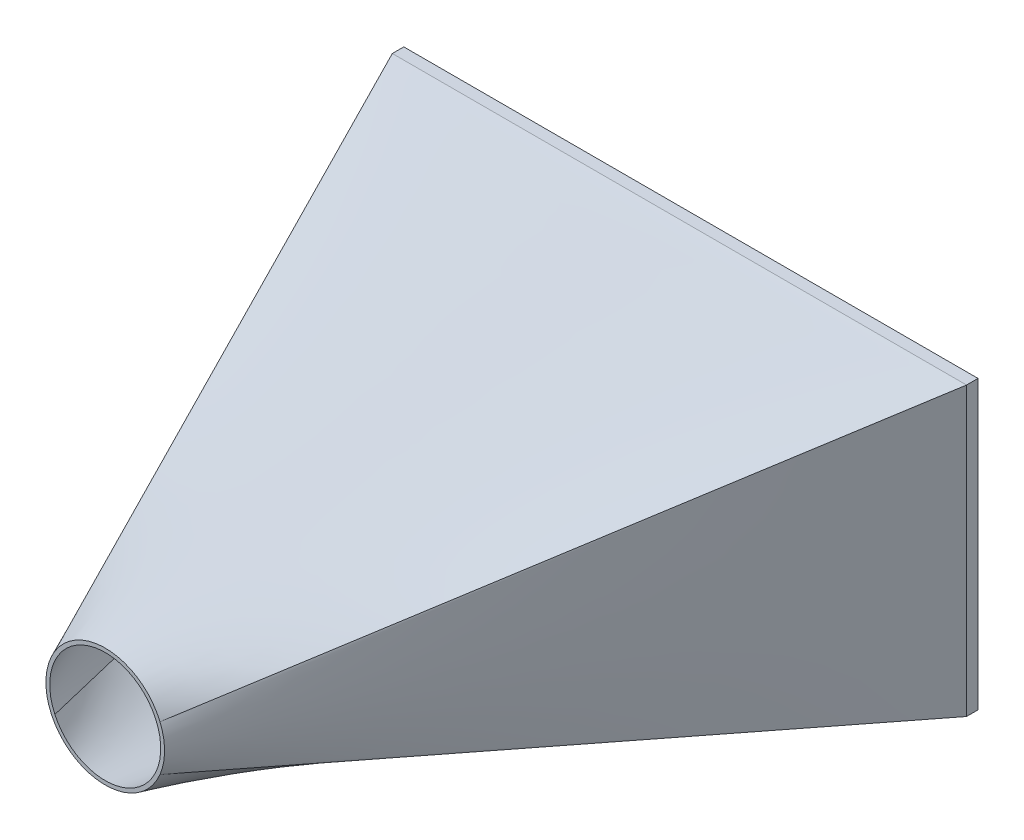
ISO-10303-21;
HEADER;
FILE_DESCRIPTION(('STEP AP214'),'2;1');
FILE_NAME('part.step','',(''),(''),'','','');
FILE_SCHEMA(('AUTOMOTIVE_DESIGN { 1 0 10303 214 1 1 1 1 }'));
ENDSEC;
DATA;
#1=APPLICATION_CONTEXT('core data for automotive mechanical design processes');
#2=APPLICATION_PROTOCOL_DEFINITION('international standard','automotive_design',2000,#1);
#3=PRODUCT_CONTEXT('',#1,'mechanical');
#4=PRODUCT('Part','Part','',(#3));
#5=PRODUCT_RELATED_PRODUCT_CATEGORY('part','',(#4));
#6=PRODUCT_DEFINITION_FORMATION('','',#4);
#7=PRODUCT_DEFINITION_CONTEXT('part definition',#1,'design');
#8=PRODUCT_DEFINITION('design','',#6,#7);
#9=PRODUCT_DEFINITION_SHAPE('','',#8);
#10=(LENGTH_UNIT() NAMED_UNIT(*) SI_UNIT(.MILLI.,.METRE.));
#11=(NAMED_UNIT(*) PLANE_ANGLE_UNIT() SI_UNIT($,.RADIAN.));
#12=(NAMED_UNIT(*) SI_UNIT($,.STERADIAN.) SOLID_ANGLE_UNIT());
#13=UNCERTAINTY_MEASURE_WITH_UNIT(LENGTH_MEASURE(1.E-05),#10,'distance_accuracy_value','');
#14=(GEOMETRIC_REPRESENTATION_CONTEXT(3) GLOBAL_UNCERTAINTY_ASSIGNED_CONTEXT((#13)) GLOBAL_UNIT_ASSIGNED_CONTEXT((#10,
#11,#12)) REPRESENTATION_CONTEXT('',''));
#15=CARTESIAN_POINT('',(0.,0.,0.));
#16=DIRECTION('',(0.,0.,1.));
#17=DIRECTION('',(1.,0.,0.));
#18=AXIS2_PLACEMENT_3D('',#15,#16,#17);
#19=CARTESIAN_POINT('',(0.,0.,150.));
#20=DIRECTION('',(0.,0.,1.));
#21=DIRECTION('',(1.,0.,0.));
#22=AXIS2_PLACEMENT_3D('',#19,#20,#21);
#23=PLANE('',#22);
#24=CARTESIAN_POINT('',(0.,0.,150.));
#25=DIRECTION('',(0.,0.,1.));
#26=DIRECTION('',(1.,0.,0.));
#27=AXIS2_PLACEMENT_3D('',#24,#25,#26);
#28=CIRCLE('',#27,14.5);
#29=CARTESIAN_POINT('',(13.1516300323523,6.10611394359212,150.));
#30=VERTEX_POINT('',#29);
#31=CARTESIAN_POINT('',(-13.1516300323523,6.10611394359212,150.));
#32=VERTEX_POINT('',#31);
#33=EDGE_CURVE('E248',#30,#32,#28,.T.);
#34=ORIENTED_EDGE('',*,*,#33,.F.);
#35=CARTESIAN_POINT('',(13.1516300323523,-6.10611394359212,150.));
#36=VERTEX_POINT('',#35);
#37=EDGE_CURVE('E230',#36,#30,#28,.T.);
#38=ORIENTED_EDGE('',*,*,#37,.F.);
#39=CARTESIAN_POINT('',(-13.1516300323523,-6.10611394359212,150.));
#40=VERTEX_POINT('',#39);
#41=EDGE_CURVE('E237',#40,#36,#28,.T.);
#42=ORIENTED_EDGE('',*,*,#41,.F.);
#43=EDGE_CURVE('E153',#32,#40,#28,.T.);
#44=ORIENTED_EDGE('',*,*,#43,.F.);
#45=EDGE_LOOP('',(#34,#38,#42,#44));
#46=FACE_BOUND('',#45,.T.);
#47=CARTESIAN_POINT('',(0.,0.,150.));
#48=DIRECTION('',(0.,0.,1.));
#49=DIRECTION('',(1.,0.,0.));
#50=AXIS2_PLACEMENT_3D('',#47,#48,#49);
#51=CIRCLE('',#50,15.5);
#52=CARTESIAN_POINT('',(-13.1439737120789,8.21498357004929,150.));
#53=VERTEX_POINT('',#52);
#54=CARTESIAN_POINT('',(-13.1439737120789,-8.21498357004929,150.));
#55=VERTEX_POINT('',#54);
#56=EDGE_CURVE('E13',#53,#55,#51,.T.);
#57=ORIENTED_EDGE('',*,*,#56,.T.);
#58=CARTESIAN_POINT('',(14.3076923076923,-5.96153846153847,150.));
#59=VERTEX_POINT('',#58);
#60=EDGE_CURVE('E159',#55,#59,#51,.T.);
#61=ORIENTED_EDGE('',*,*,#60,.T.);
#62=CARTESIAN_POINT('',(14.3076923076923,5.96153846153846,150.));
#63=VERTEX_POINT('',#62);
#64=EDGE_CURVE('E360',#59,#63,#51,.T.);
#65=ORIENTED_EDGE('',*,*,#64,.T.);
#66=EDGE_CURVE('E376',#63,#53,#51,.T.);
#67=ORIENTED_EDGE('',*,*,#66,.T.);
#68=EDGE_LOOP('',(#57,#61,#65,#67));
#69=FACE_BOUND('',#68,.T.);
#70=ADVANCED_FACE('F149',(#46,#69),#23,.T.);
#71=CARTESIAN_POINT('',(-75.,37.5,0.));
#72=CARTESIAN_POINT('',(-54.3813245706929,27.7383278566831,50.));
#73=CARTESIAN_POINT('',(-33.7626491413859,17.9766557133662,100.));
#74=CARTESIAN_POINT('',(-13.1439737120789,8.21498357004929,150.));
#75=CARTESIAN_POINT('',(-75.,34.3480913300967,0.));
#76=CARTESIAN_POINT('',(-54.5077647415209,25.4347511367561,50.));
#77=CARTESIAN_POINT('',(-34.0155294830419,16.5214109434155,100.));
#78=CARTESIAN_POINT('',(-13.5232942245628,7.60807075007492,150.));
#79=CARTESIAN_POINT('',(-75.,28.0715836517034,0.));
#80=CARTESIAN_POINT('',(-54.733578202343,20.8266137712256,49.9999999999999));
#81=CARTESIAN_POINT('',(-34.467156404686,13.5816438907478,99.9999999999999));
#82=CARTESIAN_POINT('',(-14.2007346070291,6.33667401026998,150.));
#83=CARTESIAN_POINT('',(-75.,18.7067832596335,0.));
#84=CARTESIAN_POINT('',(-54.9818213713129,13.9032874783124,50.0000000000001));
#85=CARTESIAN_POINT('',(-34.9636427426259,9.09979169699141,100.));
#86=CARTESIAN_POINT('',(-14.9454641139388,4.29629591567037,150.));
#87=CARTESIAN_POINT('',(-75.,9.36168901280311,0.));
#88=CARTESIAN_POINT('',(-55.1329990944764,6.96363626825477,49.9999999999999));
#89=CARTESIAN_POINT('',(-35.2659981889529,4.56558352370644,99.9999999999999));
#90=CARTESIAN_POINT('',(-15.3989972834294,2.1675307791581,150.));
#91=CARTESIAN_POINT('',(-75.,3.12499999999998,0.));
#92=CARTESIAN_POINT('',(-55.1666666666667,2.32384136936492,50.));
#93=CARTESIAN_POINT('',(-35.3333333333333,1.52268273872985,100.));
#94=CARTESIAN_POINT('',(-15.5,0.721524108094778,150.));
#95=CARTESIAN_POINT('',(-75.,-3.125,0.));
#96=CARTESIAN_POINT('',(-55.1666666666667,-2.32384136936492,50.));
#97=CARTESIAN_POINT('',(-35.3333333333333,-1.52268273872985,100.));
#98=CARTESIAN_POINT('',(-15.5,-0.721524108094774,150.));
#99=CARTESIAN_POINT('',(-74.9999999999999,-9.3616890128031,0.));
#100=CARTESIAN_POINT('',(-55.1329990944764,-6.96363626825476,50.));
#101=CARTESIAN_POINT('',(-35.2659981889529,-4.56558352370643,100.));
#102=CARTESIAN_POINT('',(-15.3989972834294,-2.16753077915809,150.));
#103=CARTESIAN_POINT('',(-75.0000000000001,-18.7067832596335,0.));
#104=CARTESIAN_POINT('',(-54.981821371313,-13.9032874783124,49.9999999999999));
#105=CARTESIAN_POINT('',(-34.9636427426259,-9.0997916969914,99.9999999999999));
#106=CARTESIAN_POINT('',(-14.9454641139389,-4.29629591567037,150.));
#107=CARTESIAN_POINT('',(-74.9999999999999,-28.0715836517034,0.));
#108=CARTESIAN_POINT('',(-54.733578202343,-20.8266137712256,50.0000000000001));
#109=CARTESIAN_POINT('',(-34.467156404686,-13.5816438907478,100.));
#110=CARTESIAN_POINT('',(-14.2007346070291,-6.33667401026998,150.));
#111=CARTESIAN_POINT('',(-75.,-34.3480913300968,0.));
#112=CARTESIAN_POINT('',(-54.5077647415209,-25.4347511367561,50.));
#113=CARTESIAN_POINT('',(-34.0155294830419,-16.5214109434155,100.));
#114=CARTESIAN_POINT('',(-13.5232942245628,-7.60807075007492,150.));
#115=CARTESIAN_POINT('',(-75.,-37.5,0.));
#116=CARTESIAN_POINT('',(-54.3813245706929,-27.7383278566831,50.));
#117=CARTESIAN_POINT('',(-33.7626491413859,-17.9766557133662,100.));
#118=CARTESIAN_POINT('',(-13.1439737120789,-8.21498357004929,150.));
#119=B_SPLINE_SURFACE_WITH_KNOTS('',3,3,((#71,#72,#73,#74),(#75,#76,#77,#78),(#79,#80,#81,#82),
(#83,#84,#85,#86),(#87,#88,#89,#90),(#91,#92,#93,#94),(#95,#96,#97,#98),(#99,#100,#101,#102),
(#103,#104,#105,#106),(#107,#108,#109,#110),(#111,#112,#113,#114),(#115,#116,#117,#118)),
.UNSPECIFIED.,.F.,.F.,.F.,(4,1,1,1,2,1,1,1,4),(4,4),(0.82776282442199,0.849292471369241,
0.870822118316493,0.892351765263744,0.913881412210995,0.935411059158246,0.956940706105498,
0.978470353052749,1.),(0.,1.),.UNSPECIFIED.);
#120=DIRECTION('',(0.,-1.,0.));
#121=VECTOR('',#120,1.);
#122=CARTESIAN_POINT('',(-75.,-37.5,0.));
#123=LINE('',#122,#121);
#124=CARTESIAN_POINT('',(-75.,37.5,0.));
#125=VERTEX_POINT('',#124);
#126=CARTESIAN_POINT('',(-75.,-37.5,0.));
#127=VERTEX_POINT('',#126);
#128=EDGE_CURVE('E448',#125,#127,#123,.T.);
#129=CARTESIAN_POINT('',(-75.,-37.5,0.));
#130=CARTESIAN_POINT('',(-54.3813245706929,-27.7383278566831,50.));
#131=CARTESIAN_POINT('',(-33.7626491413859,-17.9766557133662,100.));
#132=CARTESIAN_POINT('',(-13.1439737120789,-8.21498357004929,150.));
#133=B_SPLINE_CURVE_WITH_KNOTS('',3,(#129,#130,#131,#132),.UNSPECIFIED.,.F.,.F.,(4,4),(0.,1.),.UNSPECIFIED.);
#134=EDGE_CURVE('E315',#127,#55,#133,.T.);
#135=CARTESIAN_POINT('',(-75.,37.5,0.));
#136=CARTESIAN_POINT('',(-54.3813245706929,27.7383278566831,50.));
#137=CARTESIAN_POINT('',(-33.7626491413859,17.9766557133662,100.));
#138=CARTESIAN_POINT('',(-13.1439737120789,8.21498357004929,150.));
#139=B_SPLINE_CURVE_WITH_KNOTS('',3,(#135,#136,#137,#138),.UNSPECIFIED.,.F.,.F.,(4,4),(0.,1.),.UNSPECIFIED.);
#140=EDGE_CURVE('E498',#125,#53,#139,.T.);
#141=ORIENTED_EDGE('',*,*,#128,.T.);
#142=ORIENTED_EDGE('',*,*,#134,.T.);
#143=ORIENTED_EDGE('',*,*,#56,.F.);
#144=ORIENTED_EDGE('',*,*,#140,.F.);
#145=EDGE_LOOP('',(#141,#142,#143,#144));
#146=FACE_BOUND('',#145,.T.);
#147=ADVANCED_FACE('F545',(#146),#119,.T.);
#148=CARTESIAN_POINT('',(75.,37.5,0.));
#149=CARTESIAN_POINT('',(54.7692307692308,26.9871794871795,50.));
#150=CARTESIAN_POINT('',(34.5384615384615,16.474358974359,100.));
#151=CARTESIAN_POINT('',(14.3076923076923,5.96153846153846,150.));
#152=CARTESIAN_POINT('',(68.75,37.5,0.));
#153=CARTESIAN_POINT('',(50.4213828307885,27.422014539441,50.));
#154=CARTESIAN_POINT('',(32.0927656615769,17.3440290788821,100.));
#155=CARTESIAN_POINT('',(13.7641484923654,7.26604361832312,150.));
#156=CARTESIAN_POINT('',(56.25,37.5,0.));
#157=CARTESIAN_POINT('',(41.6060925384674,28.2418014610322,50.0000000000001));
#158=CARTESIAN_POINT('',(26.9621850769348,18.9836029220643,100.));
#159=CARTESIAN_POINT('',(12.3182776154021,9.7254043830965,150.));
#160=CARTESIAN_POINT('',(37.5,37.5,0.));
#161=CARTESIAN_POINT('',(28.0776991408358,29.2304387935331,49.9999999999999));
#162=CARTESIAN_POINT('',(18.6553982816716,20.9608775870662,99.9999999999998));
#163=CARTESIAN_POINT('',(9.23309742250735,12.6913163805993,150.));
#164=CARTESIAN_POINT('',(18.75,37.5,0.));
#165=CARTESIAN_POINT('',(14.3205481786736,29.9045504765037,50.0000000000001));
#166=CARTESIAN_POINT('',(9.89109635734726,22.3091009530074,100.));
#167=CARTESIAN_POINT('',(5.46164453602088,14.713651429511,150.));
#168=CARTESIAN_POINT('',(0.,37.5,0.));
#169=CARTESIAN_POINT('',(0.42800518197786,30.2139966782469,50.));
#170=CARTESIAN_POINT('',(0.856010363955703,22.9279933564937,99.9999999999999));
#171=CARTESIAN_POINT('',(1.28401554593354,15.6419900347406,150.));
#172=CARTESIAN_POINT('',(-18.75,37.5,0.));
#173=CARTESIAN_POINT('',(-13.4963598480115,30.1357840784748,50.0000000000001));
#174=CARTESIAN_POINT('',(-8.24271969602309,22.7715681569495,100.));
#175=CARTESIAN_POINT('',(-2.98907954403465,15.4073522354243,150.));
#176=CARTESIAN_POINT('',(-37.5,37.5,0.));
#177=CARTESIAN_POINT('',(-27.3466136866288,29.6757083520101,50.));
#178=CARTESIAN_POINT('',(-17.1932273732576,21.8514167040203,99.9999999999999));
#179=CARTESIAN_POINT('',(-7.03984105988643,14.0271250560304,150.));
#180=CARTESIAN_POINT('',(-56.25,37.5,0.));
#181=CARTESIAN_POINT('',(-41.022464016694,28.8680123963483,50.));
#182=CARTESIAN_POINT('',(-25.7949280333879,20.2360247926966,100.));
#183=CARTESIAN_POINT('',(-10.5673920500819,11.6040371890449,150.));
#184=CARTESIAN_POINT('',(-68.75,37.5,0.));
#185=CARTESIAN_POINT('',(-49.9649906108535,28.1377955257595,50.));
#186=CARTESIAN_POINT('',(-31.1799812217071,18.775591051519,100.));
#187=CARTESIAN_POINT('',(-12.3949718325606,9.41338657727851,150.));
#188=CARTESIAN_POINT('',(-75.,37.5,0.));
#189=CARTESIAN_POINT('',(-54.3813245706929,27.7383278566831,50.));
#190=CARTESIAN_POINT('',(-33.7626491413859,17.9766557133662,100.));
#191=CARTESIAN_POINT('',(-13.1439737120789,8.21498357004929,150.));
#192=B_SPLINE_SURFACE_WITH_KNOTS('',3,3,((#148,#149,#150,#151),(#152,#153,#154,#155),(#156,#157,
#158,#159),(#160,#161,#162,#163),(#164,#165,#166,#167),(#168,#169,#170,#171),(#172,#173,#174,
#175),(#176,#177,#178,#179),(#180,#181,#182,#183),(#184,#185,#186,#187),(#188,#189,#190,#191)),
.UNSPECIFIED.,.F.,.F.,.F.,(4,1,1,1,1,1,1,1,4),(4,4),(0.486964557972162,0.529564341278391,
0.572164124584619,0.614763907890848,0.657363691197076,0.699963474503305,0.742563257809533,
0.785163041115762,0.82776282442199),(0.,1.),.UNSPECIFIED.);
#193=DIRECTION('',(-1.,0.,0.));
#194=VECTOR('',#193,1.);
#195=CARTESIAN_POINT('',(-75.,37.5,0.));
#196=LINE('',#195,#194);
#197=CARTESIAN_POINT('',(75.,37.5,0.));
#198=VERTEX_POINT('',#197);
#199=EDGE_CURVE('E418',#198,#125,#196,.T.);
#200=CARTESIAN_POINT('',(75.,37.5,0.));
#201=CARTESIAN_POINT('',(54.7692307692308,26.9871794871795,50.));
#202=CARTESIAN_POINT('',(34.5384615384615,16.474358974359,100.));
#203=CARTESIAN_POINT('',(14.3076923076923,5.96153846153846,150.));
#204=B_SPLINE_CURVE_WITH_KNOTS('',3,(#200,#201,#202,#203),.UNSPECIFIED.,.F.,.F.,(4,4),(0.,1.),.UNSPECIFIED.);
#205=EDGE_CURVE('E496',#198,#63,#204,.T.);
#206=ORIENTED_EDGE('',*,*,#199,.T.);
#207=ORIENTED_EDGE('',*,*,#140,.T.);
#208=ORIENTED_EDGE('',*,*,#66,.F.);
#209=ORIENTED_EDGE('',*,*,#205,.F.);
#210=EDGE_LOOP('',(#206,#207,#208,#209));
#211=FACE_BOUND('',#210,.T.);
#212=ADVANCED_FACE('F535',(#211),#192,.T.);
#213=CARTESIAN_POINT('',(75.,-37.5,0.));
#214=CARTESIAN_POINT('',(54.7692307692308,-26.9871794871795,50.));
#215=CARTESIAN_POINT('',(34.5384615384615,-16.474358974359,100.));
#216=CARTESIAN_POINT('',(14.3076923076923,-5.96153846153847,150.));
#217=CARTESIAN_POINT('',(75.,-31.25,0.));
#218=CARTESIAN_POINT('',(54.8999842367419,-22.506704498486,50.));
#219=CARTESIAN_POINT('',(34.7999684734839,-13.7634089969721,100.));
#220=CARTESIAN_POINT('',(14.6999527102258,-5.02011349545814,150.));
#221=CARTESIAN_POINT('',(75.,-18.75,0.));
#222=CARTESIAN_POINT('',(55.0993623990392,-13.5198743913001,49.9999999999999));
#223=CARTESIAN_POINT('',(35.1987247980783,-8.28974878260024,99.9999999999998));
#224=CARTESIAN_POINT('',(15.2980871971175,-3.05962317390036,150.));
#225=CARTESIAN_POINT('',(75.,0.,0.));
#226=CARTESIAN_POINT('',(55.2003325301252,0.,50.0000000000001));
#227=CARTESIAN_POINT('',(35.4006650602503,0.,100.));
#228=CARTESIAN_POINT('',(15.6009975903755,0.,150.));
#229=CARTESIAN_POINT('',(75.,18.75,0.));
#230=CARTESIAN_POINT('',(55.0993623990392,13.5198743913001,49.9999999999999));
#231=CARTESIAN_POINT('',(35.1987247980783,8.28974878260024,99.9999999999998));
#232=CARTESIAN_POINT('',(15.2980871971175,3.05962317390035,150.));
#233=CARTESIAN_POINT('',(75.,31.25,0.));
#234=CARTESIAN_POINT('',(54.8999842367419,22.506704498486,50.));
#235=CARTESIAN_POINT('',(34.7999684734839,13.7634089969721,100.));
#236=CARTESIAN_POINT('',(14.6999527102258,5.02011349545814,150.));
#237=CARTESIAN_POINT('',(75.,37.5,0.));
#238=CARTESIAN_POINT('',(54.7692307692308,26.9871794871795,50.));
#239=CARTESIAN_POINT('',(34.5384615384615,16.474358974359,100.));
#240=CARTESIAN_POINT('',(14.3076923076923,5.96153846153846,150.));
#241=B_SPLINE_SURFACE_WITH_KNOTS('',3,3,((#213,#214,#215,#216),(#217,#218,#219,#220),(#221,#222,
#223,#224),(#225,#226,#227,#228),(#229,#230,#231,#232),(#233,#234,#235,#236),(#237,#238,#239,
#240)),.UNSPECIFIED.,.F.,.F.,.F.,(4,1,1,1,4),(4,4),(0.340798266449828,0.377339839330411,
0.413881412210995,0.450422985091579,0.486964557972162),(0.,1.),.UNSPECIFIED.);
#242=DIRECTION('',(0.,1.,0.));
#243=VECTOR('',#242,1.);
#244=CARTESIAN_POINT('',(75.,-37.5,0.));
#245=LINE('',#244,#243);
#246=CARTESIAN_POINT('',(75.,-37.5,0.));
#247=VERTEX_POINT('',#246);
#248=EDGE_CURVE('E463',#247,#198,#245,.T.);
#249=CARTESIAN_POINT('',(75.,-37.5,0.));
#250=CARTESIAN_POINT('',(54.7692307692308,-26.9871794871795,50.));
#251=CARTESIAN_POINT('',(34.5384615384615,-16.474358974359,100.));
#252=CARTESIAN_POINT('',(14.3076923076923,-5.96153846153847,150.));
#253=B_SPLINE_CURVE_WITH_KNOTS('',3,(#249,#250,#251,#252),.UNSPECIFIED.,.F.,.F.,(4,4),(0.,1.),.UNSPECIFIED.);
#254=EDGE_CURVE('E495',#247,#59,#253,.T.);
#255=ORIENTED_EDGE('',*,*,#248,.T.);
#256=ORIENTED_EDGE('',*,*,#205,.T.);
#257=ORIENTED_EDGE('',*,*,#64,.F.);
#258=ORIENTED_EDGE('',*,*,#254,.F.);
#259=EDGE_LOOP('',(#255,#256,#257,#258));
#260=FACE_BOUND('',#259,.T.);
#261=ADVANCED_FACE('F330',(#260),#241,.T.);
#262=CARTESIAN_POINT('',(-75.,-37.5,0.));
#263=CARTESIAN_POINT('',(-54.3813245706929,-27.7383278566831,50.));
#264=CARTESIAN_POINT('',(-33.7626491413859,-17.9766557133662,100.));
#265=CARTESIAN_POINT('',(-13.1439737120789,-8.21498357004929,150.));
#266=CARTESIAN_POINT('',(-68.75,-37.5,0.));
#267=CARTESIAN_POINT('',(-49.9649906108535,-28.1377955257595,50.));
#268=CARTESIAN_POINT('',(-31.1799812217071,-18.775591051519,100.));
#269=CARTESIAN_POINT('',(-12.3949718325606,-9.41338657727851,150.));
#270=CARTESIAN_POINT('',(-56.25,-37.5,0.));
#271=CARTESIAN_POINT('',(-41.022464016694,-28.8680123963483,50.));
#272=CARTESIAN_POINT('',(-25.7949280333879,-20.2360247926966,99.9999999999999));
#273=CARTESIAN_POINT('',(-10.5673920500819,-11.6040371890449,150.));
#274=CARTESIAN_POINT('',(-37.5,-37.5,0.));
#275=CARTESIAN_POINT('',(-27.3466136866288,-29.6757083520101,50.));
#276=CARTESIAN_POINT('',(-17.1932273732576,-21.8514167040202,100.));
#277=CARTESIAN_POINT('',(-7.03984105988644,-14.0271250560304,150.));
#278=CARTESIAN_POINT('',(-18.75,-37.5,0.));
#279=CARTESIAN_POINT('',(-13.4963598480115,-30.1357840784748,50.));
#280=CARTESIAN_POINT('',(-8.2427196960231,-22.7715681569495,100.));
#281=CARTESIAN_POINT('',(-2.98907954403466,-15.4073522354243,150.));
#282=CARTESIAN_POINT('',(0.,-37.5,0.));
#283=CARTESIAN_POINT('',(0.428005181977863,-30.2139966782469,50.));
#284=CARTESIAN_POINT('',(0.856010363955692,-22.9279933564937,99.9999999999999));
#285=CARTESIAN_POINT('',(1.28401554593352,-15.6419900347405,150.));
#286=CARTESIAN_POINT('',(18.75,-37.5,0.));
#287=CARTESIAN_POINT('',(14.3205481786736,-29.9045504765037,50.0000000000001));
#288=CARTESIAN_POINT('',(9.89109635734727,-22.3091009530074,100.));
#289=CARTESIAN_POINT('',(5.4616445360209,-14.7136514295111,150.));
#290=CARTESIAN_POINT('',(37.5,-37.5,0.));
#291=CARTESIAN_POINT('',(28.0776991408358,-29.2304387935331,50.));
#292=CARTESIAN_POINT('',(18.6553982816716,-20.9608775870662,99.9999999999999));
#293=CARTESIAN_POINT('',(9.23309742250732,-12.6913163805993,150.));
#294=CARTESIAN_POINT('',(56.25,-37.5,0.));
#295=CARTESIAN_POINT('',(41.6060925384674,-28.2418014610322,50.));
#296=CARTESIAN_POINT('',(26.9621850769348,-18.9836029220644,100.));
#297=CARTESIAN_POINT('',(12.3182776154021,-9.72540438309654,150.));
#298=CARTESIAN_POINT('',(68.75,-37.5,0.));
#299=CARTESIAN_POINT('',(50.4213828307885,-27.422014539441,50.));
#300=CARTESIAN_POINT('',(32.0927656615769,-17.3440290788821,100.));
#301=CARTESIAN_POINT('',(13.7641484923654,-7.26604361832312,150.));
#302=CARTESIAN_POINT('',(75.,-37.5,0.));
#303=CARTESIAN_POINT('',(54.7692307692308,-26.9871794871795,50.));
#304=CARTESIAN_POINT('',(34.5384615384615,-16.474358974359,100.));
#305=CARTESIAN_POINT('',(14.3076923076923,-5.96153846153847,150.));
#306=B_SPLINE_SURFACE_WITH_KNOTS('',3,3,((#262,#263,#264,#265),(#266,#267,#268,#269),(#270,#271,
#272,#273),(#274,#275,#276,#277),(#278,#279,#280,#281),(#282,#283,#284,#285),(#286,#287,#288,
#289),(#290,#291,#292,#293),(#294,#295,#296,#297),(#298,#299,#300,#301),(#302,#303,#304,#305)),
.UNSPECIFIED.,.F.,.F.,.F.,(4,1,1,1,1,1,1,1,4),(4,4),(0.,0.0425997833062285,0.085199566612457,
0.127799349918685,0.170399133224914,0.212998916531142,0.255598699837371,0.298198483143599,
0.340798266449828),(0.,1.),.UNSPECIFIED.);
#307=DIRECTION('',(1.,0.,0.));
#308=VECTOR('',#307,1.);
#309=CARTESIAN_POINT('',(-75.,-37.5,0.));
#310=LINE('',#309,#308);
#311=EDGE_CURVE('E310',#127,#247,#310,.T.);
#312=ORIENTED_EDGE('',*,*,#311,.T.);
#313=ORIENTED_EDGE('',*,*,#254,.T.);
#314=ORIENTED_EDGE('',*,*,#60,.F.);
#315=ORIENTED_EDGE('',*,*,#134,.F.);
#316=EDGE_LOOP('',(#312,#313,#314,#315));
#317=FACE_BOUND('',#316,.T.);
#318=ADVANCED_FACE('F317',(#317),#306,.T.);
#319=CARTESIAN_POINT('',(75.,-37.5,-3.));
#320=DIRECTION('',(0.,1.,0.));
#321=DIRECTION('',(0.,0.,1.));
#322=AXIS2_PLACEMENT_3D('',#319,#320,#321);
#323=PLANE('',#322);
#324=ORIENTED_EDGE('',*,*,#311,.F.);
#325=DIRECTION('',(0.,0.,1.));
#326=VECTOR('',#325,1.);
#327=CARTESIAN_POINT('',(-75.,-37.5,-3.));
#328=LINE('',#327,#326);
#329=CARTESIAN_POINT('',(-75.,-37.5,-3.));
#330=VERTEX_POINT('',#329);
#331=EDGE_CURVE('E410',#330,#127,#328,.T.);
#332=ORIENTED_EDGE('',*,*,#331,.F.);
#333=DIRECTION('',(-1.,0.,0.));
#334=VECTOR('',#333,1.);
#335=CARTESIAN_POINT('',(75.,-37.5,-3.));
#336=LINE('',#335,#334);
#337=CARTESIAN_POINT('',(75.,-37.5,-3.));
#338=VERTEX_POINT('',#337);
#339=EDGE_CURVE('E276',#338,#330,#336,.T.);
#340=ORIENTED_EDGE('',*,*,#339,.F.);
#341=DIRECTION('',(0.,0.,1.));
#342=VECTOR('',#341,1.);
#343=CARTESIAN_POINT('',(75.,-37.5,-3.));
#344=LINE('',#343,#342);
#345=EDGE_CURVE('E303',#338,#247,#344,.T.);
#346=ORIENTED_EDGE('',*,*,#345,.T.);
#347=EDGE_LOOP('',(#324,#332,#340,#346));
#348=FACE_BOUND('',#347,.T.);
#349=ADVANCED_FACE('F329',(#348),#323,.F.);
#350=CARTESIAN_POINT('',(-75.,-37.5,-3.));
#351=DIRECTION('',(1.,0.,0.));
#352=DIRECTION('',(0.,0.,-1.));
#353=AXIS2_PLACEMENT_3D('',#350,#351,#352);
#354=PLANE('',#353);
#355=ORIENTED_EDGE('',*,*,#128,.F.);
#356=DIRECTION('',(0.,0.,1.));
#357=VECTOR('',#356,1.);
#358=CARTESIAN_POINT('',(-75.,37.5,-3.));
#359=LINE('',#358,#357);
#360=CARTESIAN_POINT('',(-75.,37.5,-3.));
#361=VERTEX_POINT('',#360);
#362=EDGE_CURVE('E403',#361,#125,#359,.T.);
#363=ORIENTED_EDGE('',*,*,#362,.F.);
#364=DIRECTION('',(0.,1.,0.));
#365=VECTOR('',#364,1.);
#366=CARTESIAN_POINT('',(-75.,-37.5,-3.));
#367=LINE('',#366,#365);
#368=EDGE_CURVE('E297',#330,#361,#367,.T.);
#369=ORIENTED_EDGE('',*,*,#368,.F.);
#370=ORIENTED_EDGE('',*,*,#331,.T.);
#371=EDGE_LOOP('',(#355,#363,#369,#370));
#372=FACE_BOUND('',#371,.T.);
#373=ADVANCED_FACE('F435',(#372),#354,.F.);
#374=CARTESIAN_POINT('',(-75.,37.5,-3.));
#375=DIRECTION('',(0.,-1.,0.));
#376=DIRECTION('',(0.,0.,-1.));
#377=AXIS2_PLACEMENT_3D('',#374,#375,#376);
#378=PLANE('',#377);
#379=ORIENTED_EDGE('',*,*,#199,.F.);
#380=DIRECTION('',(0.,0.,1.));
#381=VECTOR('',#380,1.);
#382=CARTESIAN_POINT('',(75.,37.5,-3.));
#383=LINE('',#382,#381);
#384=CARTESIAN_POINT('',(75.,37.5,-3.));
#385=VERTEX_POINT('',#384);
#386=EDGE_CURVE('E411',#385,#198,#383,.T.);
#387=ORIENTED_EDGE('',*,*,#386,.F.);
#388=DIRECTION('',(1.,0.,0.));
#389=VECTOR('',#388,1.);
#390=CARTESIAN_POINT('',(-75.,37.5,-3.));
#391=LINE('',#390,#389);
#392=EDGE_CURVE('E299',#361,#385,#391,.T.);
#393=ORIENTED_EDGE('',*,*,#392,.F.);
#394=ORIENTED_EDGE('',*,*,#362,.T.);
#395=EDGE_LOOP('',(#379,#387,#393,#394));
#396=FACE_BOUND('',#395,.T.);
#397=ADVANCED_FACE('F425',(#396),#378,.F.);
#398=CARTESIAN_POINT('',(75.,37.5,-3.));
#399=DIRECTION('',(-1.,0.,0.));
#400=DIRECTION('',(0.,0.,1.));
#401=AXIS2_PLACEMENT_3D('',#398,#399,#400);
#402=PLANE('',#401);
#403=ORIENTED_EDGE('',*,*,#248,.F.);
#404=ORIENTED_EDGE('',*,*,#345,.F.);
#405=DIRECTION('',(0.,-1.,0.));
#406=VECTOR('',#405,1.);
#407=CARTESIAN_POINT('',(75.,37.5,-3.));
#408=LINE('',#407,#406);
#409=EDGE_CURVE('E301',#385,#338,#408,.T.);
#410=ORIENTED_EDGE('',*,*,#409,.F.);
#411=ORIENTED_EDGE('',*,*,#386,.T.);
#412=EDGE_LOOP('',(#403,#404,#410,#411));
#413=FACE_BOUND('',#412,.T.);
#414=ADVANCED_FACE('F434',(#413),#402,.F.);
#415=CARTESIAN_POINT('',(0.,0.,-3.));
#416=DIRECTION('',(0.,0.,-1.));
#417=DIRECTION('',(-1.,0.,0.));
#418=AXIS2_PLACEMENT_3D('',#415,#416,#417);
#419=PLANE('',#418);
#420=DIRECTION('',(1.,0.,0.));
#421=VECTOR('',#420,1.);
#422=CARTESIAN_POINT('',(70.,32.5,-3.));
#423=LINE('',#422,#421);
#424=CARTESIAN_POINT('',(-70.,32.5,-3.));
#425=VERTEX_POINT('',#424);
#426=CARTESIAN_POINT('',(70.,32.5,-3.));
#427=VERTEX_POINT('',#426);
#428=EDGE_CURVE('E291',#425,#427,#423,.T.);
#429=ORIENTED_EDGE('',*,*,#428,.F.);
#430=DIRECTION('',(0.,1.,0.));
#431=VECTOR('',#430,1.);
#432=CARTESIAN_POINT('',(-70.,-32.5,-3.));
#433=LINE('',#432,#431);
#434=CARTESIAN_POINT('',(-70.,-32.5,-3.));
#435=VERTEX_POINT('',#434);
#436=EDGE_CURVE('E277',#435,#425,#433,.T.);
#437=ORIENTED_EDGE('',*,*,#436,.F.);
#438=DIRECTION('',(-1.,0.,0.));
#439=VECTOR('',#438,1.);
#440=CARTESIAN_POINT('',(70.,-32.5,-3.));
#441=LINE('',#440,#439);
#442=CARTESIAN_POINT('',(70.,-32.5,-3.));
#443=VERTEX_POINT('',#442);
#444=EDGE_CURVE('E268',#443,#435,#441,.T.);
#445=ORIENTED_EDGE('',*,*,#444,.F.);
#446=DIRECTION('',(0.,-1.,0.));
#447=VECTOR('',#446,1.);
#448=CARTESIAN_POINT('',(70.,-32.5,-3.));
#449=LINE('',#448,#447);
#450=EDGE_CURVE('E175',#427,#443,#449,.T.);
#451=ORIENTED_EDGE('',*,*,#450,.F.);
#452=EDGE_LOOP('',(#429,#437,#445,#451));
#453=FACE_BOUND('',#452,.T.);
#454=ORIENTED_EDGE('',*,*,#339,.T.);
#455=ORIENTED_EDGE('',*,*,#368,.T.);
#456=ORIENTED_EDGE('',*,*,#392,.T.);
#457=ORIENTED_EDGE('',*,*,#409,.T.);
#458=EDGE_LOOP('',(#454,#455,#456,#457));
#459=FACE_BOUND('',#458,.T.);
#460=ADVANCED_FACE('F636',(#453,#459),#419,.T.);
#461=CARTESIAN_POINT('',(-13.1516300323523,6.10611394359212,150.));
#462=CARTESIAN_POINT('',(-70.,32.5,-3.));
#463=CARTESIAN_POINT('',(-12.6901050236079,7.10016780857988,150.));
#464=CARTESIAN_POINT('',(-64.1666666666666,32.5,-3.));
#465=CARTESIAN_POINT('',(-12.0808999858437,8.11643830474612,150.));
#466=CARTESIAN_POINT('',(-58.3333333333332,32.5,-3.));
#467=CARTESIAN_POINT('',(-10.5068783944548,10.0712572019012,150.));
#468=CARTESIAN_POINT('',(-46.6666666666664,32.5,-3.));
#469=CARTESIAN_POINT('',(-9.54021530530295,11.008809349352,150.));
#470=CARTESIAN_POINT('',(-40.8333333333331,32.5,-3.));
#471=CARTESIAN_POINT('',(-7.82857879932804,12.2251074360592,150.));
#472=CARTESIAN_POINT('',(-32.083333333333,32.5,-3.));
#473=CARTESIAN_POINT('',(-7.2151788739899,12.5985415863797,150.));
#474=CARTESIAN_POINT('',(-29.1666666666663,32.5,-3.));
#475=CARTESIAN_POINT('',(-5.91441506949121,13.2590252535088,150.));
#476=CARTESIAN_POINT('',(-23.333333333333,32.5,-3.));
#477=CARTESIAN_POINT('',(-5.22706854778502,13.545971609496,150.));
#478=CARTESIAN_POINT('',(-20.4166666666663,32.5,-3.));
#479=CARTESIAN_POINT('',(-3.79763713086558,14.0140481186125,150.));
#480=CARTESIAN_POINT('',(-14.5833333333329,32.5,-3.));
#481=CARTESIAN_POINT('',(-3.05561927593157,14.1950854067465,150.));
#482=CARTESIAN_POINT('',(-11.6666666666663,32.5,-3.));
#483=CARTESIAN_POINT('',(-1.54234974460503,14.4380890747214,150.));
#484=CARTESIAN_POINT('',(-5.83333333333294,32.5,-3.));
#485=CARTESIAN_POINT('',(-0.771205720751669,14.5,150.));
#486=CARTESIAN_POINT('',(-2.91666666666628,32.5,-3.));
#487=CARTESIAN_POINT('',(0.77120572075167,14.5,150.));
#488=CARTESIAN_POINT('',(2.91666666666705,32.5,-3.));
#489=CARTESIAN_POINT('',(1.54234974460503,14.4380890747214,150.));
#490=CARTESIAN_POINT('',(5.83333333333372,32.5,-3.));
#491=CARTESIAN_POINT('',(3.05561927593157,14.1950854067465,150.));
#492=CARTESIAN_POINT('',(11.6666666666671,32.5,-3.));
#493=CARTESIAN_POINT('',(3.79763713086558,14.0140481186125,150.));
#494=CARTESIAN_POINT('',(14.5833333333337,32.5,-3.));
#495=CARTESIAN_POINT('',(5.22706854778503,13.545971609496,150.));
#496=CARTESIAN_POINT('',(20.416666666667,32.5,-3.));
#497=CARTESIAN_POINT('',(5.91441506949121,13.2590252535088,150.));
#498=CARTESIAN_POINT('',(23.3333333333337,32.5,-3.));
#499=CARTESIAN_POINT('',(7.2151788739899,12.5985415863797,150.));
#500=CARTESIAN_POINT('',(29.166666666667,32.5,-3.));
#501=CARTESIAN_POINT('',(7.82857879932804,12.2251074360592,150.));
#502=CARTESIAN_POINT('',(32.0833333333337,32.5,-3.));
#503=CARTESIAN_POINT('',(9.54021530530295,11.008809349352,150.));
#504=CARTESIAN_POINT('',(40.8333333333336,32.5,-3.));
#505=CARTESIAN_POINT('',(10.5068783944548,10.0712572019012,150.));
#506=CARTESIAN_POINT('',(46.6666666666669,32.5,-3.));
#507=CARTESIAN_POINT('',(12.0808999858437,8.11643830474612,150.));
#508=CARTESIAN_POINT('',(58.3333333333335,32.5,-3.));
#509=CARTESIAN_POINT('',(12.6901050236079,7.10016780857988,150.));
#510=CARTESIAN_POINT('',(64.1666666666667,32.5,-3.));
#511=CARTESIAN_POINT('',(13.1516300323523,6.10611394359212,150.));
#512=CARTESIAN_POINT('',(70.,32.5,-3.));
#513=B_SPLINE_SURFACE_WITH_KNOTS('',3,1,((#461,#462),(#463,#464),(#465,#466),(#467,#468),(#469,
#470),(#471,#472),(#473,#474),(#475,#476),(#477,#478),(#479,#480),(#481,#482),(#483,#484),(#485,
#486),(#487,#488),(#489,#490),(#491,#492),(#493,#494),(#495,#496),(#497,#498),(#499,#500),(#501,
#502),(#503,#504),(#505,#506),(#507,#508),(#509,#510),(#511,#512)),.UNSPECIFIED.,.F.,.F.,.F.,(4,
2,2,2,2,2,2,2,2,2,2,2,4),(2,2),(0.,0.125,0.25,0.3125,0.375,0.4375,0.5,0.5625,0.625,0.6875,0.75,
0.875,1.),(0.,1.),.UNSPECIFIED.);
#514=DIRECTION('',(0.343826713688684,-0.15963383135546,0.925364917662657));
#515=VECTOR('',#514,1.);
#516=CARTESIAN_POINT('',(-41.5758150161761,19.3030569717961,73.5));
#517=LINE('',#516,#515);
#518=EDGE_CURVE('E250',#425,#32,#517,.T.);
#519=DIRECTION('',(0.343826713688684,0.15963383135546,-0.925364917662657));
#520=VECTOR('',#519,1.);
#521=CARTESIAN_POINT('',(41.5758150161761,19.3030569717961,73.5));
#522=LINE('',#521,#520);
#523=EDGE_CURVE('E234',#30,#427,#522,.T.);
#524=ORIENTED_EDGE('',*,*,#33,.T.);
#525=ORIENTED_EDGE('',*,*,#518,.F.);
#526=ORIENTED_EDGE('',*,*,#428,.T.);
#527=ORIENTED_EDGE('',*,*,#523,.F.);
#528=EDGE_LOOP('',(#524,#525,#526,#527));
#529=FACE_BOUND('',#528,.T.);
#530=ADVANCED_FACE('F642',(#529),#513,.F.);
#531=CARTESIAN_POINT('',(13.1516300323523,6.10611394359212,150.));
#532=CARTESIAN_POINT('',(70.,32.5,-3.));
#533=CARTESIAN_POINT('',(13.5801889690434,5.18306392610349,150.));
#534=CARTESIAN_POINT('',(70.,27.0833333333333,-3.));
#535=CARTESIAN_POINT('',(13.9206840841841,4.19242562982917,150.));
#536=CARTESIAN_POINT('',(70.,21.6666666666667,-3.));
#537=CARTESIAN_POINT('',(14.3807715462419,2.13431201282881,150.));
#538=CARTESIAN_POINT('',(70.,10.8333333333333,-3.));
#539=CARTESIAN_POINT('',(14.5,1.06731082493746,150.));
#540=CARTESIAN_POINT('',(70.,5.41666666666668,-3.));
#541=CARTESIAN_POINT('',(14.5,-1.06731082493746,150.));
#542=CARTESIAN_POINT('',(70.,-5.41666666666665,-3.));
#543=CARTESIAN_POINT('',(14.3807715462419,-2.13431201282881,150.));
#544=CARTESIAN_POINT('',(70.,-10.8333333333333,-3.));
#545=CARTESIAN_POINT('',(13.9206840841841,-4.19242562982917,150.));
#546=CARTESIAN_POINT('',(70.,-21.6666666666667,-3.));
#547=CARTESIAN_POINT('',(13.5801889690434,-5.18306392610349,150.));
#548=CARTESIAN_POINT('',(70.,-27.0833333333333,-3.));
#549=CARTESIAN_POINT('',(13.1516300323523,-6.10611394359212,150.));
#550=CARTESIAN_POINT('',(70.,-32.5,-3.));
#551=B_SPLINE_SURFACE_WITH_KNOTS('',3,1,((#531,#532),(#533,#534),(#535,#536),(#537,#538),(#539,
#540),(#541,#542),(#543,#544),(#545,#546),(#547,#548),(#549,#550)),.UNSPECIFIED.,.F.,.F.,.F.,(4,
2,2,2,4),(2,2),(0.,0.25,0.5,0.75,1.),(0.,1.),.UNSPECIFIED.);
#552=DIRECTION('',(0.343826713688684,-0.15963383135546,-0.925364917662657));
#553=VECTOR('',#552,1.);
#554=CARTESIAN_POINT('',(41.5758150161761,-19.3030569717961,73.5));
#555=LINE('',#554,#553);
#556=EDGE_CURVE('E227',#36,#443,#555,.T.);
#557=ORIENTED_EDGE('',*,*,#37,.T.);
#558=ORIENTED_EDGE('',*,*,#523,.T.);
#559=ORIENTED_EDGE('',*,*,#450,.T.);
#560=ORIENTED_EDGE('',*,*,#556,.F.);
#561=EDGE_LOOP('',(#557,#558,#559,#560));
#562=FACE_BOUND('',#561,.T.);
#563=ADVANCED_FACE('F228',(#562),#551,.F.);
#564=CARTESIAN_POINT('',(-13.1516300323523,-6.10611394359212,150.));
#565=CARTESIAN_POINT('',(-70.,-32.5,-3.));
#566=CARTESIAN_POINT('',(-13.5801889690434,-5.18306392610349,150.));
#567=CARTESIAN_POINT('',(-70.,-27.0833333333333,-3.));
#568=CARTESIAN_POINT('',(-13.9206840841842,-4.19242562982917,150.));
#569=CARTESIAN_POINT('',(-70.,-21.6666666666667,-3.));
#570=CARTESIAN_POINT('',(-14.3807715462419,-2.13431201282881,150.));
#571=CARTESIAN_POINT('',(-70.,-10.8333333333333,-3.));
#572=CARTESIAN_POINT('',(-14.5,-1.06731082493746,150.));
#573=CARTESIAN_POINT('',(-70.,-5.41666666666666,-3.));
#574=CARTESIAN_POINT('',(-14.5,1.06731082493746,150.));
#575=CARTESIAN_POINT('',(-70.,5.41666666666667,-3.));
#576=CARTESIAN_POINT('',(-14.3807715462419,2.13431201282881,150.));
#577=CARTESIAN_POINT('',(-70.,10.8333333333333,-3.));
#578=CARTESIAN_POINT('',(-13.9206840841841,4.19242562982917,150.));
#579=CARTESIAN_POINT('',(-70.,21.6666666666667,-3.));
#580=CARTESIAN_POINT('',(-13.5801889690434,5.18306392610349,150.));
#581=CARTESIAN_POINT('',(-70.,27.0833333333333,-3.));
#582=CARTESIAN_POINT('',(-13.1516300323523,6.10611394359212,150.));
#583=CARTESIAN_POINT('',(-70.,32.5,-3.));
#584=B_SPLINE_SURFACE_WITH_KNOTS('',3,1,((#564,#565),(#566,#567),(#568,#569),(#570,#571),(#572,
#573),(#574,#575),(#576,#577),(#578,#579),(#580,#581),(#582,#583)),.UNSPECIFIED.,.F.,.F.,.F.,(4,
2,2,2,4),(2,2),(0.,0.25,0.5,0.75,1.),(0.,1.),.UNSPECIFIED.);
#585=DIRECTION('',(-0.343826713688684,-0.15963383135546,-0.925364917662657));
#586=VECTOR('',#585,1.);
#587=CARTESIAN_POINT('',(-41.5758150161761,-19.3030569717961,73.5));
#588=LINE('',#587,#586);
#589=EDGE_CURVE('E167',#40,#435,#588,.T.);
#590=ORIENTED_EDGE('',*,*,#43,.T.);
#591=ORIENTED_EDGE('',*,*,#589,.T.);
#592=ORIENTED_EDGE('',*,*,#436,.T.);
#593=ORIENTED_EDGE('',*,*,#518,.T.);
#594=EDGE_LOOP('',(#590,#591,#592,#593));
#595=FACE_BOUND('',#594,.T.);
#596=ADVANCED_FACE('F656',(#595),#584,.F.);
#597=CARTESIAN_POINT('',(13.1516300323523,-6.10611394359212,150.));
#598=CARTESIAN_POINT('',(70.,-32.5,-3.));
#599=CARTESIAN_POINT('',(12.6901050236079,-7.10016780857988,150.));
#600=CARTESIAN_POINT('',(64.1666666666667,-32.5,-3.));
#601=CARTESIAN_POINT('',(12.0808999858437,-8.11643830474612,150.));
#602=CARTESIAN_POINT('',(58.3333333333334,-32.5,-3.));
#603=CARTESIAN_POINT('',(10.5068783944548,-10.0712572019012,150.));
#604=CARTESIAN_POINT('',(46.6666666666668,-32.5,-3.));
#605=CARTESIAN_POINT('',(9.54021530530295,-11.008809349352,150.));
#606=CARTESIAN_POINT('',(40.8333333333335,-32.5,-3.));
#607=CARTESIAN_POINT('',(7.82857879932804,-12.2251074360592,150.));
#608=CARTESIAN_POINT('',(32.0833333333336,-32.5,-3.));
#609=CARTESIAN_POINT('',(7.2151788739899,-12.5985415863797,150.));
#610=CARTESIAN_POINT('',(29.1666666666669,-32.5,-3.));
#611=CARTESIAN_POINT('',(5.9144150694912,-13.2590252535088,150.));
#612=CARTESIAN_POINT('',(23.3333333333336,-32.5,-3.));
#613=CARTESIAN_POINT('',(5.22706854778502,-13.545971609496,150.));
#614=CARTESIAN_POINT('',(20.4166666666669,-32.5,-3.));
#615=CARTESIAN_POINT('',(3.79763713086557,-14.0140481186125,150.));
#616=CARTESIAN_POINT('',(14.5833333333336,-32.5,-3.));
#617=CARTESIAN_POINT('',(3.05561927593157,-14.1950854067465,150.));
#618=CARTESIAN_POINT('',(11.6666666666669,-32.5,-3.));
#619=CARTESIAN_POINT('',(1.54234974460503,-14.4380890747214,150.));
#620=CARTESIAN_POINT('',(5.8333333333336,-32.5,-3.));
#621=CARTESIAN_POINT('',(0.771205720751666,-14.5,150.));
#622=CARTESIAN_POINT('',(2.91666666666692,-32.5,-3.));
#623=CARTESIAN_POINT('',(-0.771205720751673,-14.5,150.));
#624=CARTESIAN_POINT('',(-2.91666666666641,-32.5,-3.));
#625=CARTESIAN_POINT('',(-1.54234974460504,-14.4380890747214,150.));
#626=CARTESIAN_POINT('',(-5.83333333333308,-32.5,-3.));
#627=CARTESIAN_POINT('',(-3.05561927593157,-14.1950854067465,150.));
#628=CARTESIAN_POINT('',(-11.6666666666664,-32.5,-3.));
#629=CARTESIAN_POINT('',(-3.79763713086558,-14.0140481186125,150.));
#630=CARTESIAN_POINT('',(-14.5833333333331,-32.5,-3.));
#631=CARTESIAN_POINT('',(-5.22706854778503,-13.545971609496,150.));
#632=CARTESIAN_POINT('',(-20.4166666666664,-32.5,-3.));
#633=CARTESIAN_POINT('',(-5.91441506949121,-13.2590252535088,150.));
#634=CARTESIAN_POINT('',(-23.3333333333331,-32.5,-3.));
#635=CARTESIAN_POINT('',(-7.21517887398991,-12.5985415863797,150.));
#636=CARTESIAN_POINT('',(-29.1666666666664,-32.5,-3.));
#637=CARTESIAN_POINT('',(-7.82857879932804,-12.2251074360592,150.));
#638=CARTESIAN_POINT('',(-32.0833333333331,-32.5,-3.));
#639=CARTESIAN_POINT('',(-9.54021530530296,-11.008809349352,150.));
#640=CARTESIAN_POINT('',(-40.8333333333332,-32.5,-3.));
#641=CARTESIAN_POINT('',(-10.5068783944548,-10.0712572019012,150.));
#642=CARTESIAN_POINT('',(-46.6666666666665,-32.5,-3.));
#643=CARTESIAN_POINT('',(-12.0808999858437,-8.11643830474612,150.));
#644=CARTESIAN_POINT('',(-58.3333333333333,-32.5,-3.));
#645=CARTESIAN_POINT('',(-12.6901050236079,-7.10016780857988,150.));
#646=CARTESIAN_POINT('',(-64.1666666666666,-32.5,-3.));
#647=CARTESIAN_POINT('',(-13.1516300323523,-6.10611394359212,150.));
#648=CARTESIAN_POINT('',(-70.,-32.5,-3.));
#649=B_SPLINE_SURFACE_WITH_KNOTS('',3,1,((#597,#598),(#599,#600),(#601,#602),(#603,#604),(#605,
#606),(#607,#608),(#609,#610),(#611,#612),(#613,#614),(#615,#616),(#617,#618),(#619,#620),(#621,
#622),(#623,#624),(#625,#626),(#627,#628),(#629,#630),(#631,#632),(#633,#634),(#635,#636),(#637,
#638),(#639,#640),(#641,#642),(#643,#644),(#645,#646),(#647,#648)),.UNSPECIFIED.,.F.,.F.,.F.,(4,
2,2,2,2,2,2,2,2,2,2,2,4),(2,2),(0.,0.125,0.25,0.3125,0.375,0.4375,0.5,0.5625,0.625,0.6875,0.75,
0.875,1.),(0.,1.),.UNSPECIFIED.);
#650=ORIENTED_EDGE('',*,*,#41,.T.);
#651=ORIENTED_EDGE('',*,*,#556,.T.);
#652=ORIENTED_EDGE('',*,*,#444,.T.);
#653=ORIENTED_EDGE('',*,*,#589,.F.);
#654=EDGE_LOOP('',(#650,#651,#652,#653));
#655=FACE_BOUND('',#654,.T.);
#656=ADVANCED_FACE('F239',(#655),#649,.F.);
#657=CLOSED_SHELL('',(#70,#147,#212,#261,#318,#349,#373,#397,#414,#460,#530,#563,#596,#656));
#658=MANIFOLD_SOLID_BREP('B2',#657);
#659=ADVANCED_BREP_SHAPE_REPRESENTATION('',(#18,#658),#14);
#660=SHAPE_DEFINITION_REPRESENTATION(#9,#659);
ENDSEC;
END-ISO-10303-21;
